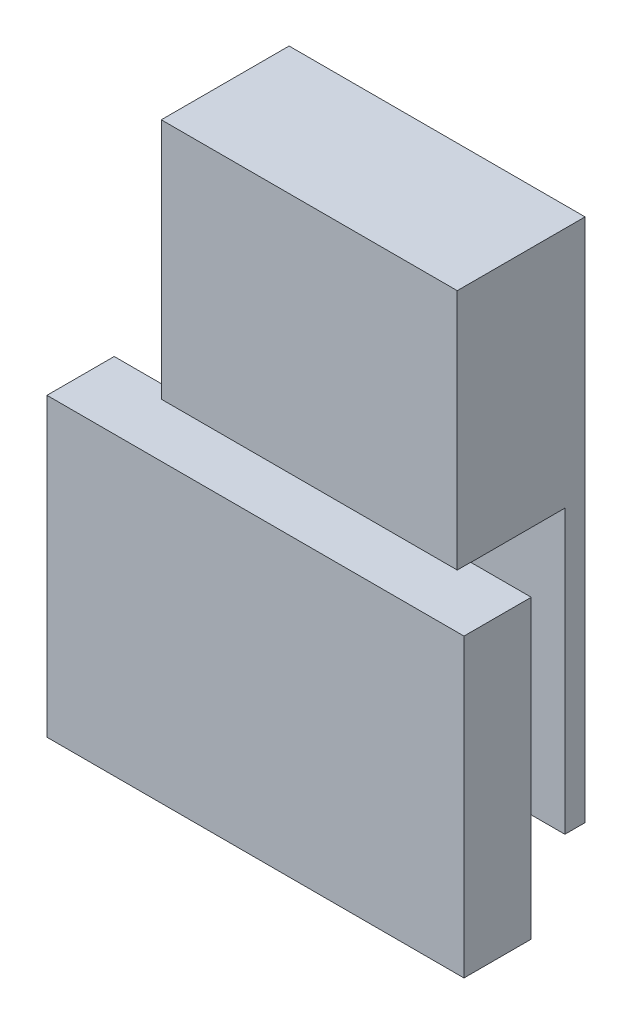
ISO-10303-21;
HEADER;
FILE_DESCRIPTION(('STEP AP214'),'2;1');
FILE_NAME('part.step','',(''),(''),'','','');
FILE_SCHEMA(('AUTOMOTIVE_DESIGN { 1 0 10303 214 1 1 1 1 }'));
ENDSEC;
DATA;
#1=APPLICATION_CONTEXT('core data for automotive mechanical design processes');
#2=APPLICATION_PROTOCOL_DEFINITION('international standard','automotive_design',2000,#1);
#3=PRODUCT_CONTEXT('',#1,'mechanical');
#4=PRODUCT('Part','Part','',(#3));
#5=PRODUCT_RELATED_PRODUCT_CATEGORY('part','',(#4));
#6=PRODUCT_DEFINITION_FORMATION('','',#4);
#7=PRODUCT_DEFINITION_CONTEXT('part definition',#1,'design');
#8=PRODUCT_DEFINITION('design','',#6,#7);
#9=PRODUCT_DEFINITION_SHAPE('','',#8);
#10=(LENGTH_UNIT() NAMED_UNIT(*) SI_UNIT(.MILLI.,.METRE.));
#11=(NAMED_UNIT(*) PLANE_ANGLE_UNIT() SI_UNIT($,.RADIAN.));
#12=(NAMED_UNIT(*) SI_UNIT($,.STERADIAN.) SOLID_ANGLE_UNIT());
#13=UNCERTAINTY_MEASURE_WITH_UNIT(LENGTH_MEASURE(1.E-05),#10,'distance_accuracy_value','');
#14=(GEOMETRIC_REPRESENTATION_CONTEXT(3) GLOBAL_UNCERTAINTY_ASSIGNED_CONTEXT((#13)) GLOBAL_UNIT_ASSIGNED_CONTEXT((#10,
#11,#12)) REPRESENTATION_CONTEXT('',''));
#15=CARTESIAN_POINT('',(0.,0.,0.));
#16=DIRECTION('',(0.,0.,1.));
#17=DIRECTION('',(1.,0.,0.));
#18=AXIS2_PLACEMENT_3D('',#15,#16,#17);
#19=CARTESIAN_POINT('',(-27.94,-49.53,3.81));
#20=DIRECTION('',(1.,0.,0.));
#21=DIRECTION('',(0.,0.,-1.));
#22=AXIS2_PLACEMENT_3D('',#19,#20,#21);
#23=PLANE('',#22);
#24=DIRECTION('',(0.,0.,-1.));
#25=VECTOR('',#24,1.);
#26=CARTESIAN_POINT('',(-27.94,3.84178918201172,3.81));
#27=LINE('',#26,#25);
#28=CARTESIAN_POINT('',(-27.94,3.84178918201172,24.13));
#29=VERTEX_POINT('',#28);
#30=CARTESIAN_POINT('',(-27.94,3.84178918201172,21.59));
#31=VERTEX_POINT('',#30);
#32=EDGE_CURVE('E141',#29,#31,#27,.T.);
#33=ORIENTED_EDGE('',*,*,#32,.F.);
#34=DIRECTION('',(0.,-1.,0.));
#35=VECTOR('',#34,1.);
#36=CARTESIAN_POINT('',(-27.94,49.53,24.13));
#37=LINE('',#36,#35);
#38=CARTESIAN_POINT('',(-27.94,49.53,24.13));
#39=VERTEX_POINT('',#38);
#40=EDGE_CURVE('E103',#39,#29,#37,.T.);
#41=ORIENTED_EDGE('',*,*,#40,.F.);
#42=DIRECTION('',(0.,0.,-1.));
#43=VECTOR('',#42,1.);
#44=CARTESIAN_POINT('',(-27.94,49.53,3.81));
#45=LINE('',#44,#43);
#46=CARTESIAN_POINT('',(-27.94,49.53,0.));
#47=VERTEX_POINT('',#46);
#48=EDGE_CURVE('E86',#39,#47,#45,.T.);
#49=ORIENTED_EDGE('',*,*,#48,.T.);
#50=DIRECTION('',(0.,-1.,0.));
#51=VECTOR('',#50,1.);
#52=CARTESIAN_POINT('',(-27.94,-49.53,0.));
#53=LINE('',#52,#51);
#54=CARTESIAN_POINT('',(-27.94,-49.53,0.));
#55=VERTEX_POINT('',#54);
#56=EDGE_CURVE('E101',#47,#55,#53,.T.);
#57=ORIENTED_EDGE('',*,*,#56,.T.);
#58=DIRECTION('',(0.,0.,-1.));
#59=VECTOR('',#58,1.);
#60=CARTESIAN_POINT('',(-27.94,-49.53,3.81));
#61=LINE('',#60,#59);
#62=CARTESIAN_POINT('',(-27.94,-49.53,3.81));
#63=VERTEX_POINT('',#62);
#64=EDGE_CURVE('E46',#63,#55,#61,.T.);
#65=ORIENTED_EDGE('',*,*,#64,.F.);
#66=DIRECTION('',(0.,-1.,0.));
#67=VECTOR('',#66,1.);
#68=CARTESIAN_POINT('',(-27.94,-49.53,3.81));
#69=LINE('',#68,#67);
#70=CARTESIAN_POINT('',(-27.94,3.80999999999999,3.81));
#71=VERTEX_POINT('',#70);
#72=EDGE_CURVE('E93',#71,#63,#69,.T.);
#73=ORIENTED_EDGE('',*,*,#72,.F.);
#74=DIRECTION('',(0.,0.,-1.));
#75=VECTOR('',#74,1.);
#76=CARTESIAN_POINT('',(-27.94,3.80999999999999,24.13));
#77=LINE('',#76,#75);
#78=CARTESIAN_POINT('',(-27.94,3.80999999999999,21.59));
#79=VERTEX_POINT('',#78);
#80=EDGE_CURVE('E53',#79,#71,#77,.T.);
#81=ORIENTED_EDGE('',*,*,#80,.F.);
#82=DIRECTION('',(0.,-1.,0.));
#83=VECTOR('',#82,1.);
#84=CARTESIAN_POINT('',(-27.94,-49.53,21.59));
#85=LINE('',#84,#83);
#86=EDGE_CURVE('E149',#31,#79,#85,.T.);
#87=ORIENTED_EDGE('',*,*,#86,.F.);
#88=EDGE_LOOP('',(#33,#41,#49,#57,#65,#73,#81,#87));
#89=FACE_BOUND('',#88,.T.);
#90=ADVANCED_FACE('F39',(#89),#23,.F.);
#91=CARTESIAN_POINT('',(27.94,-49.53,3.81));
#92=DIRECTION('',(-1.,0.,0.));
#93=DIRECTION('',(0.,0.,1.));
#94=AXIS2_PLACEMENT_3D('',#91,#92,#93);
#95=PLANE('',#94);
#96=DIRECTION('',(0.,0.,1.));
#97=VECTOR('',#96,1.);
#98=CARTESIAN_POINT('',(27.94,3.84178918201172,3.81));
#99=LINE('',#98,#97);
#100=CARTESIAN_POINT('',(27.94,3.84178918201172,21.59));
#101=VERTEX_POINT('',#100);
#102=CARTESIAN_POINT('',(27.94,3.84178918201172,24.13));
#103=VERTEX_POINT('',#102);
#104=EDGE_CURVE('E146',#101,#103,#99,.T.);
#105=ORIENTED_EDGE('',*,*,#104,.F.);
#106=DIRECTION('',(0.,1.,0.));
#107=VECTOR('',#106,1.);
#108=CARTESIAN_POINT('',(27.94,-49.53,21.59));
#109=LINE('',#108,#107);
#110=CARTESIAN_POINT('',(27.94,3.80999999999999,21.59));
#111=VERTEX_POINT('',#110);
#112=EDGE_CURVE('E152',#111,#101,#109,.T.);
#113=ORIENTED_EDGE('',*,*,#112,.F.);
#114=DIRECTION('',(0.,0.,-1.));
#115=VECTOR('',#114,1.);
#116=CARTESIAN_POINT('',(27.94,3.80999999999999,24.13));
#117=LINE('',#116,#115);
#118=CARTESIAN_POINT('',(27.94,3.80999999999999,3.81));
#119=VERTEX_POINT('',#118);
#120=EDGE_CURVE('E111',#111,#119,#117,.T.);
#121=ORIENTED_EDGE('',*,*,#120,.T.);
#122=DIRECTION('',(0.,1.,0.));
#123=VECTOR('',#122,1.);
#124=CARTESIAN_POINT('',(27.94,-49.53,3.81));
#125=LINE('',#124,#123);
#126=CARTESIAN_POINT('',(27.94,-49.53,3.81));
#127=VERTEX_POINT('',#126);
#128=EDGE_CURVE('E104',#127,#119,#125,.T.);
#129=ORIENTED_EDGE('',*,*,#128,.F.);
#130=DIRECTION('',(0.,0.,-1.));
#131=VECTOR('',#130,1.);
#132=CARTESIAN_POINT('',(27.94,-49.53,3.81));
#133=LINE('',#132,#131);
#134=CARTESIAN_POINT('',(27.94,-49.53,0.));
#135=VERTEX_POINT('',#134);
#136=EDGE_CURVE('E118',#127,#135,#133,.T.);
#137=ORIENTED_EDGE('',*,*,#136,.T.);
#138=DIRECTION('',(0.,1.,0.));
#139=VECTOR('',#138,1.);
#140=CARTESIAN_POINT('',(27.94,-49.53,0.));
#141=LINE('',#140,#139);
#142=CARTESIAN_POINT('',(27.94,49.53,0.));
#143=VERTEX_POINT('',#142);
#144=EDGE_CURVE('E94',#135,#143,#141,.T.);
#145=ORIENTED_EDGE('',*,*,#144,.T.);
#146=DIRECTION('',(0.,0.,-1.));
#147=VECTOR('',#146,1.);
#148=CARTESIAN_POINT('',(27.94,49.53,3.81));
#149=LINE('',#148,#147);
#150=CARTESIAN_POINT('',(27.94,49.53,24.13));
#151=VERTEX_POINT('',#150);
#152=EDGE_CURVE('E89',#151,#143,#149,.T.);
#153=ORIENTED_EDGE('',*,*,#152,.F.);
#154=DIRECTION('',(0.,1.,0.));
#155=VECTOR('',#154,1.);
#156=CARTESIAN_POINT('',(27.94,49.53,24.13));
#157=LINE('',#156,#155);
#158=EDGE_CURVE('E134',#103,#151,#157,.T.);
#159=ORIENTED_EDGE('',*,*,#158,.F.);
#160=EDGE_LOOP('',(#105,#113,#121,#129,#137,#145,#153,#159));
#161=FACE_BOUND('',#160,.T.);
#162=ADVANCED_FACE('F251',(#161),#95,.F.);
#163=CARTESIAN_POINT('',(0.,0.,24.13));
#164=DIRECTION('',(0.,0.,1.));
#165=DIRECTION('',(1.,0.,0.));
#166=AXIS2_PLACEMENT_3D('',#163,#164,#165);
#167=PLANE('',#166);
#168=ORIENTED_EDGE('',*,*,#40,.T.);
#169=DIRECTION('',(1.,0.,0.));
#170=VECTOR('',#169,1.);
#171=CARTESIAN_POINT('',(0.,3.84178918201172,24.13));
#172=LINE('',#171,#170);
#173=EDGE_CURVE('E11',#29,#103,#172,.T.);
#174=ORIENTED_EDGE('',*,*,#173,.T.);
#175=ORIENTED_EDGE('',*,*,#158,.T.);
#176=DIRECTION('',(-1.,0.,0.));
#177=VECTOR('',#176,1.);
#178=CARTESIAN_POINT('',(-27.94,49.53,24.13));
#179=LINE('',#178,#177);
#180=EDGE_CURVE('E129',#151,#39,#179,.T.);
#181=ORIENTED_EDGE('',*,*,#180,.T.);
#182=EDGE_LOOP('',(#168,#174,#175,#181));
#183=FACE_BOUND('',#182,.T.);
#184=ADVANCED_FACE('F255',(#183),#167,.T.);
#185=CARTESIAN_POINT('',(-27.94,3.80999999999999,24.13));
#186=DIRECTION('',(0.,1.,0.));
#187=DIRECTION('',(0.,0.,1.));
#188=AXIS2_PLACEMENT_3D('',#185,#186,#187);
#189=PLANE('',#188);
#190=DIRECTION('',(1.,0.,0.));
#191=VECTOR('',#190,1.);
#192=CARTESIAN_POINT('',(-27.94,3.80999999999999,21.59));
#193=LINE('',#192,#191);
#194=EDGE_CURVE('E138',#79,#111,#193,.T.);
#195=ORIENTED_EDGE('',*,*,#194,.F.);
#196=ORIENTED_EDGE('',*,*,#80,.T.);
#197=DIRECTION('',(1.,0.,0.));
#198=VECTOR('',#197,1.);
#199=CARTESIAN_POINT('',(-27.94,3.80999999999999,3.81));
#200=LINE('',#199,#198);
#201=EDGE_CURVE('E130',#71,#119,#200,.T.);
#202=ORIENTED_EDGE('',*,*,#201,.T.);
#203=ORIENTED_EDGE('',*,*,#120,.F.);
#204=EDGE_LOOP('',(#195,#196,#202,#203));
#205=FACE_BOUND('',#204,.T.);
#206=ADVANCED_FACE('F253',(#205),#189,.F.);
#207=CARTESIAN_POINT('',(27.94,-49.53,3.81));
#208=DIRECTION('',(0.,1.,0.));
#209=DIRECTION('',(-1.,0.,0.));
#210=AXIS2_PLACEMENT_3D('',#207,#208,#209);
#211=PLANE('',#210);
#212=DIRECTION('',(1.,0.,0.));
#213=VECTOR('',#212,1.);
#214=CARTESIAN_POINT('',(27.94,-49.53,0.));
#215=LINE('',#214,#213);
#216=EDGE_CURVE('E107',#55,#135,#215,.T.);
#217=ORIENTED_EDGE('',*,*,#216,.T.);
#218=ORIENTED_EDGE('',*,*,#136,.F.);
#219=DIRECTION('',(1.,0.,0.));
#220=VECTOR('',#219,1.);
#221=CARTESIAN_POINT('',(27.94,-49.53,3.81));
#222=LINE('',#221,#220);
#223=EDGE_CURVE('E62',#63,#127,#222,.T.);
#224=ORIENTED_EDGE('',*,*,#223,.F.);
#225=ORIENTED_EDGE('',*,*,#64,.T.);
#226=EDGE_LOOP('',(#217,#218,#224,#225));
#227=FACE_BOUND('',#226,.T.);
#228=ADVANCED_FACE('F121',(#227),#211,.F.);
#229=CARTESIAN_POINT('',(27.94,49.53,3.81));
#230=DIRECTION('',(0.,-1.,0.));
#231=DIRECTION('',(0.,0.,-1.));
#232=AXIS2_PLACEMENT_3D('',#229,#230,#231);
#233=PLANE('',#232);
#234=DIRECTION('',(-1.,0.,0.));
#235=VECTOR('',#234,1.);
#236=CARTESIAN_POINT('',(27.94,49.53,0.));
#237=LINE('',#236,#235);
#238=EDGE_CURVE('E82',#143,#47,#237,.T.);
#239=ORIENTED_EDGE('',*,*,#238,.T.);
#240=ORIENTED_EDGE('',*,*,#48,.F.);
#241=ORIENTED_EDGE('',*,*,#180,.F.);
#242=ORIENTED_EDGE('',*,*,#152,.T.);
#243=EDGE_LOOP('',(#239,#240,#241,#242));
#244=FACE_BOUND('',#243,.T.);
#245=ADVANCED_FACE('F84',(#244),#233,.F.);
#246=CARTESIAN_POINT('',(0.,0.,3.81));
#247=DIRECTION('',(0.,0.,1.));
#248=DIRECTION('',(1.,0.,0.));
#249=AXIS2_PLACEMENT_3D('',#246,#247,#248);
#250=PLANE('',#249);
#251=ORIENTED_EDGE('',*,*,#201,.F.);
#252=ORIENTED_EDGE('',*,*,#72,.T.);
#253=ORIENTED_EDGE('',*,*,#223,.T.);
#254=ORIENTED_EDGE('',*,*,#128,.T.);
#255=EDGE_LOOP('',(#251,#252,#253,#254));
#256=FACE_BOUND('',#255,.T.);
#257=ADVANCED_FACE('F252',(#256),#250,.T.);
#258=CARTESIAN_POINT('',(0.,0.,0.));
#259=DIRECTION('',(0.,0.,1.));
#260=DIRECTION('',(1.,0.,0.));
#261=AXIS2_PLACEMENT_3D('',#258,#259,#260);
#262=PLANE('',#261);
#263=ORIENTED_EDGE('',*,*,#56,.F.);
#264=ORIENTED_EDGE('',*,*,#238,.F.);
#265=ORIENTED_EDGE('',*,*,#144,.F.);
#266=ORIENTED_EDGE('',*,*,#216,.F.);
#267=EDGE_LOOP('',(#263,#264,#265,#266));
#268=FACE_BOUND('',#267,.T.);
#269=ADVANCED_FACE('F106',(#268),#262,.F.);
#270=CARTESIAN_POINT('',(-27.94,-52.07,21.59));
#271=DIRECTION('',(0.,0.,1.));
#272=DIRECTION('',(1.,0.,0.));
#273=AXIS2_PLACEMENT_3D('',#270,#271,#272);
#274=PLANE('',#273);
#275=ORIENTED_EDGE('',*,*,#194,.T.);
#276=ORIENTED_EDGE('',*,*,#112,.T.);
#277=DIRECTION('',(1.,0.,0.));
#278=VECTOR('',#277,1.);
#279=CARTESIAN_POINT('',(0.,3.84178918201172,21.59));
#280=LINE('',#279,#278);
#281=CARTESIAN_POINT('',(39.37,3.84178918201172,21.59));
#282=VERTEX_POINT('',#281);
#283=EDGE_CURVE('E176',#101,#282,#280,.T.);
#284=ORIENTED_EDGE('',*,*,#283,.T.);
#285=DIRECTION('',(0.,1.,0.));
#286=VECTOR('',#285,1.);
#287=CARTESIAN_POINT('',(39.37,0.,21.59));
#288=LINE('',#287,#286);
#289=CARTESIAN_POINT('',(39.37,-52.07,21.59));
#290=VERTEX_POINT('',#289);
#291=EDGE_CURVE('E160',#290,#282,#288,.T.);
#292=ORIENTED_EDGE('',*,*,#291,.F.);
#293=DIRECTION('',(1.,0.,0.));
#294=VECTOR('',#293,1.);
#295=CARTESIAN_POINT('',(-27.94,-52.07,21.59));
#296=LINE('',#295,#294);
#297=CARTESIAN_POINT('',(-39.37,-52.07,21.59));
#298=VERTEX_POINT('',#297);
#299=EDGE_CURVE('E132',#298,#290,#296,.T.);
#300=ORIENTED_EDGE('',*,*,#299,.F.);
#301=DIRECTION('',(0.,1.,0.));
#302=VECTOR('',#301,1.);
#303=CARTESIAN_POINT('',(-39.37,0.,21.59));
#304=LINE('',#303,#302);
#305=CARTESIAN_POINT('',(-39.37,3.84178918201172,21.59));
#306=VERTEX_POINT('',#305);
#307=EDGE_CURVE('E170',#298,#306,#304,.T.);
#308=ORIENTED_EDGE('',*,*,#307,.T.);
#309=EDGE_CURVE('E173',#306,#31,#280,.T.);
#310=ORIENTED_EDGE('',*,*,#309,.T.);
#311=ORIENTED_EDGE('',*,*,#86,.T.);
#312=EDGE_LOOP('',(#275,#276,#284,#292,#300,#308,#310,#311));
#313=FACE_BOUND('',#312,.T.);
#314=ADVANCED_FACE('F228',(#313),#274,.F.);
#315=CARTESIAN_POINT('',(0.,-52.07,0.));
#316=DIRECTION('',(0.,-1.,0.));
#317=DIRECTION('',(0.,0.,-1.));
#318=AXIS2_PLACEMENT_3D('',#315,#316,#317);
#319=PLANE('',#318);
#320=DIRECTION('',(0.,0.,1.));
#321=VECTOR('',#320,1.);
#322=CARTESIAN_POINT('',(-39.37,-52.07,21.59));
#323=LINE('',#322,#321);
#324=CARTESIAN_POINT('',(-39.37,-52.07,34.29));
#325=VERTEX_POINT('',#324);
#326=EDGE_CURVE('E159',#298,#325,#323,.T.);
#327=ORIENTED_EDGE('',*,*,#326,.F.);
#328=ORIENTED_EDGE('',*,*,#299,.T.);
#329=DIRECTION('',(0.,0.,1.));
#330=VECTOR('',#329,1.);
#331=CARTESIAN_POINT('',(39.37,-52.07,21.59));
#332=LINE('',#331,#330);
#333=CARTESIAN_POINT('',(39.37,-52.07,34.29));
#334=VERTEX_POINT('',#333);
#335=EDGE_CURVE('E163',#290,#334,#332,.T.);
#336=ORIENTED_EDGE('',*,*,#335,.T.);
#337=DIRECTION('',(1.,0.,0.));
#338=VECTOR('',#337,1.);
#339=CARTESIAN_POINT('',(0.,-52.07,34.29));
#340=LINE('',#339,#338);
#341=EDGE_CURVE('E180',#325,#334,#340,.T.);
#342=ORIENTED_EDGE('',*,*,#341,.F.);
#343=EDGE_LOOP('',(#327,#328,#336,#342));
#344=FACE_BOUND('',#343,.T.);
#345=ADVANCED_FACE('F216',(#344),#319,.T.);
#346=CARTESIAN_POINT('',(0.,3.84178918201172,21.59));
#347=DIRECTION('',(0.,-1.,0.));
#348=DIRECTION('',(0.,0.,-1.));
#349=AXIS2_PLACEMENT_3D('',#346,#347,#348);
#350=PLANE('',#349);
#351=ORIENTED_EDGE('',*,*,#173,.F.);
#352=ORIENTED_EDGE('',*,*,#32,.T.);
#353=ORIENTED_EDGE('',*,*,#309,.F.);
#354=DIRECTION('',(0.,0.,1.));
#355=VECTOR('',#354,1.);
#356=CARTESIAN_POINT('',(-39.37,3.84178918201172,21.59));
#357=LINE('',#356,#355);
#358=CARTESIAN_POINT('',(-39.37,3.84178918201172,34.29));
#359=VERTEX_POINT('',#358);
#360=EDGE_CURVE('E156',#306,#359,#357,.T.);
#361=ORIENTED_EDGE('',*,*,#360,.T.);
#362=DIRECTION('',(1.,0.,0.));
#363=VECTOR('',#362,1.);
#364=CARTESIAN_POINT('',(0.,3.84178918201172,34.29));
#365=LINE('',#364,#363);
#366=CARTESIAN_POINT('',(39.37,3.84178918201172,34.29));
#367=VERTEX_POINT('',#366);
#368=EDGE_CURVE('E186',#359,#367,#365,.T.);
#369=ORIENTED_EDGE('',*,*,#368,.T.);
#370=DIRECTION('',(0.,0.,1.));
#371=VECTOR('',#370,1.);
#372=CARTESIAN_POINT('',(39.37,3.84178918201172,21.59));
#373=LINE('',#372,#371);
#374=EDGE_CURVE('E155',#282,#367,#373,.T.);
#375=ORIENTED_EDGE('',*,*,#374,.F.);
#376=ORIENTED_EDGE('',*,*,#283,.F.);
#377=ORIENTED_EDGE('',*,*,#104,.T.);
#378=EDGE_LOOP('',(#351,#352,#353,#361,#369,#375,#376,#377));
#379=FACE_BOUND('',#378,.T.);
#380=ADVANCED_FACE('F193',(#379),#350,.F.);
#381=CARTESIAN_POINT('',(39.37,0.,21.59));
#382=DIRECTION('',(1.,0.,0.));
#383=DIRECTION('',(0.,0.,-1.));
#384=AXIS2_PLACEMENT_3D('',#381,#382,#383);
#385=PLANE('',#384);
#386=ORIENTED_EDGE('',*,*,#374,.T.);
#387=DIRECTION('',(0.,1.,0.));
#388=VECTOR('',#387,1.);
#389=CARTESIAN_POINT('',(39.37,0.,34.29));
#390=LINE('',#389,#388);
#391=EDGE_CURVE('E177',#334,#367,#390,.T.);
#392=ORIENTED_EDGE('',*,*,#391,.F.);
#393=ORIENTED_EDGE('',*,*,#335,.F.);
#394=ORIENTED_EDGE('',*,*,#291,.T.);
#395=EDGE_LOOP('',(#386,#392,#393,#394));
#396=FACE_BOUND('',#395,.T.);
#397=ADVANCED_FACE('F220',(#396),#385,.T.);
#398=CARTESIAN_POINT('',(-39.37,0.,21.59));
#399=DIRECTION('',(1.,0.,0.));
#400=DIRECTION('',(0.,0.,-1.));
#401=AXIS2_PLACEMENT_3D('',#398,#399,#400);
#402=PLANE('',#401);
#403=ORIENTED_EDGE('',*,*,#326,.T.);
#404=DIRECTION('',(0.,1.,0.));
#405=VECTOR('',#404,1.);
#406=CARTESIAN_POINT('',(-39.37,0.,34.29));
#407=LINE('',#406,#405);
#408=EDGE_CURVE('E183',#325,#359,#407,.T.);
#409=ORIENTED_EDGE('',*,*,#408,.T.);
#410=ORIENTED_EDGE('',*,*,#360,.F.);
#411=ORIENTED_EDGE('',*,*,#307,.F.);
#412=EDGE_LOOP('',(#403,#409,#410,#411));
#413=FACE_BOUND('',#412,.T.);
#414=ADVANCED_FACE('F209',(#413),#402,.F.);
#415=CARTESIAN_POINT('',(0.,0.,34.29));
#416=DIRECTION('',(0.,0.,1.));
#417=DIRECTION('',(1.,0.,0.));
#418=AXIS2_PLACEMENT_3D('',#415,#416,#417);
#419=PLANE('',#418);
#420=ORIENTED_EDGE('',*,*,#368,.F.);
#421=ORIENTED_EDGE('',*,*,#408,.F.);
#422=ORIENTED_EDGE('',*,*,#341,.T.);
#423=ORIENTED_EDGE('',*,*,#391,.T.);
#424=EDGE_LOOP('',(#420,#421,#422,#423));
#425=FACE_BOUND('',#424,.T.);
#426=ADVANCED_FACE('F204',(#425),#419,.T.);
#427=CLOSED_SHELL('',(#90,#162,#184,#206,#228,#245,#257,#269,#314,#345,#380,#397,#414,#426));
#428=MANIFOLD_SOLID_BREP('B2',#427);
#429=ADVANCED_BREP_SHAPE_REPRESENTATION('',(#18,#428),#14);
#430=SHAPE_DEFINITION_REPRESENTATION(#9,#429);
ENDSEC;
END-ISO-10303-21;
